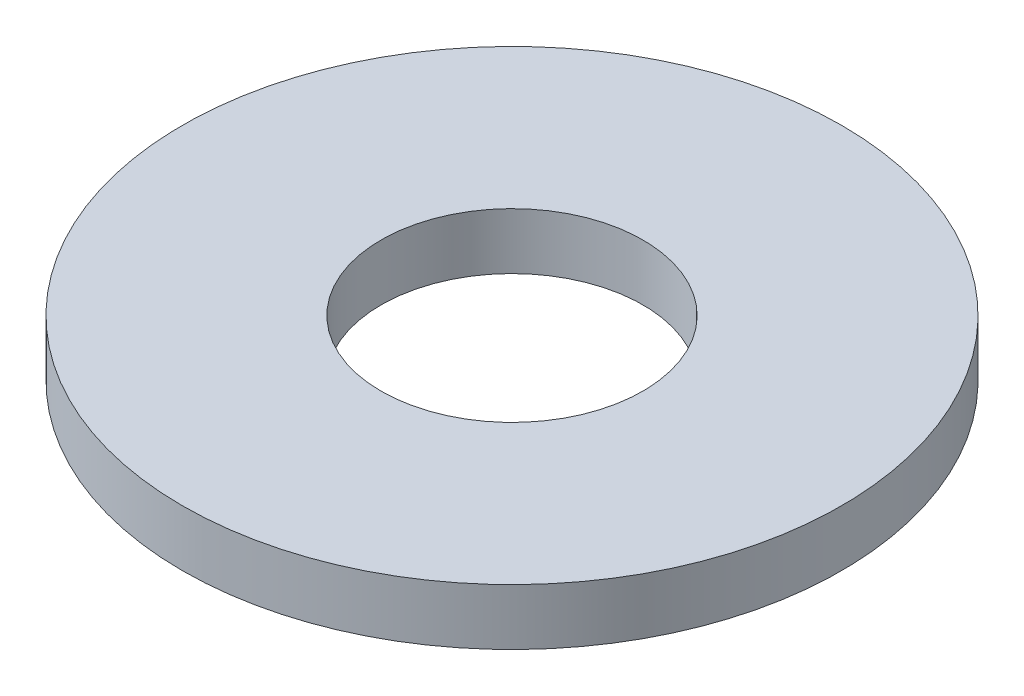
ISO-10303-21;
HEADER;
FILE_DESCRIPTION(('STEP AP214'),'2;1');
FILE_NAME('part.step','',(''),(''),'','','');
FILE_SCHEMA(('AUTOMOTIVE_DESIGN { 1 0 10303 214 1 1 1 1 }'));
ENDSEC;
DATA;
#1=APPLICATION_CONTEXT('core data for automotive mechanical design processes');
#2=APPLICATION_PROTOCOL_DEFINITION('international standard','automotive_design',2000,#1);
#3=PRODUCT_CONTEXT('',#1,'mechanical');
#4=PRODUCT('Part','Part','',(#3));
#5=PRODUCT_RELATED_PRODUCT_CATEGORY('part','',(#4));
#6=PRODUCT_DEFINITION_FORMATION('','',#4);
#7=PRODUCT_DEFINITION_CONTEXT('part definition',#1,'design');
#8=PRODUCT_DEFINITION('design','',#6,#7);
#9=PRODUCT_DEFINITION_SHAPE('','',#8);
#10=(LENGTH_UNIT() NAMED_UNIT(*) SI_UNIT(.MILLI.,.METRE.));
#11=(NAMED_UNIT(*) PLANE_ANGLE_UNIT() SI_UNIT($,.RADIAN.));
#12=(NAMED_UNIT(*) SI_UNIT($,.STERADIAN.) SOLID_ANGLE_UNIT());
#13=UNCERTAINTY_MEASURE_WITH_UNIT(LENGTH_MEASURE(1.E-05),#10,'distance_accuracy_value','');
#14=(GEOMETRIC_REPRESENTATION_CONTEXT(3) GLOBAL_UNCERTAINTY_ASSIGNED_CONTEXT((#13)) GLOBAL_UNIT_ASSIGNED_CONTEXT((#10,
#11,#12)) REPRESENTATION_CONTEXT('',''));
#15=CARTESIAN_POINT('',(0.,0.,0.));
#16=DIRECTION('',(0.,0.,1.));
#17=DIRECTION('',(1.,0.,0.));
#18=AXIS2_PLACEMENT_3D('',#15,#16,#17);
#19=CARTESIAN_POINT('',(0.,0.8128,0.));
#20=DIRECTION('',(0.,1.,0.));
#21=DIRECTION('',(0.,0.,1.));
#22=AXIS2_PLACEMENT_3D('',#19,#20,#21);
#23=PLANE('',#22);
#24=CARTESIAN_POINT('',(0.,0.8128,0.));
#25=DIRECTION('',(0.,1.,0.));
#26=DIRECTION('',(0.,0.,1.));
#27=AXIS2_PLACEMENT_3D('',#24,#25,#26);
#28=CIRCLE('',#27,4.7625);
#29=CARTESIAN_POINT('',(0.,0.8128,4.7625));
#30=VERTEX_POINT('',#29);
#31=EDGE_CURVE('E10',#30,#30,#28,.T.);
#32=ORIENTED_EDGE('',*,*,#31,.T.);
#33=EDGE_LOOP('',(#32));
#34=FACE_BOUND('',#33,.T.);
#35=CARTESIAN_POINT('',(0.,0.8128,0.));
#36=DIRECTION('',(0.,1.,0.));
#37=DIRECTION('',(0.,0.,1.));
#38=AXIS2_PLACEMENT_3D('',#35,#36,#37);
#39=CIRCLE('',#38,1.8923);
#40=CARTESIAN_POINT('',(0.,0.8128,1.8923));
#41=VERTEX_POINT('',#40);
#42=EDGE_CURVE('E41',#41,#41,#39,.T.);
#43=ORIENTED_EDGE('',*,*,#42,.F.);
#44=EDGE_LOOP('',(#43));
#45=FACE_BOUND('',#44,.T.);
#46=ADVANCED_FACE('F30',(#34,#45),#23,.T.);
#47=CARTESIAN_POINT('',(0.,0.,0.));
#48=DIRECTION('',(0.,1.,0.));
#49=DIRECTION('',(0.,0.,1.));
#50=AXIS2_PLACEMENT_3D('',#47,#48,#49);
#51=PLANE('',#50);
#52=CARTESIAN_POINT('',(0.,0.,0.));
#53=DIRECTION('',(0.,1.,0.));
#54=DIRECTION('',(0.,0.,1.));
#55=AXIS2_PLACEMENT_3D('',#52,#53,#54);
#56=CIRCLE('',#55,4.7625);
#57=CARTESIAN_POINT('',(0.,0.,4.7625));
#58=VERTEX_POINT('',#57);
#59=EDGE_CURVE('E34',#58,#58,#56,.T.);
#60=ORIENTED_EDGE('',*,*,#59,.F.);
#61=EDGE_LOOP('',(#60));
#62=FACE_BOUND('',#61,.T.);
#63=CARTESIAN_POINT('',(0.,0.,0.));
#64=DIRECTION('',(0.,1.,0.));
#65=DIRECTION('',(0.,0.,1.));
#66=AXIS2_PLACEMENT_3D('',#63,#64,#65);
#67=CIRCLE('',#66,1.8923);
#68=CARTESIAN_POINT('',(0.,0.,1.8923));
#69=VERTEX_POINT('',#68);
#70=EDGE_CURVE('E43',#69,#69,#67,.T.);
#71=ORIENTED_EDGE('',*,*,#70,.T.);
#72=EDGE_LOOP('',(#71));
#73=FACE_BOUND('',#72,.T.);
#74=ADVANCED_FACE('F53',(#62,#73),#51,.F.);
#75=CARTESIAN_POINT('',(0.,0.8128,0.));
#76=DIRECTION('',(0.,-1.,0.));
#77=DIRECTION('',(0.,0.,-1.));
#78=AXIS2_PLACEMENT_3D('',#75,#76,#77);
#79=CYLINDRICAL_SURFACE('',#78,4.7625);
#80=ORIENTED_EDGE('',*,*,#31,.F.);
#81=EDGE_LOOP('',(#80));
#82=FACE_BOUND('',#81,.T.);
#83=ORIENTED_EDGE('',*,*,#59,.T.);
#84=EDGE_LOOP('',(#83));
#85=FACE_BOUND('',#84,.T.);
#86=ADVANCED_FACE('F32',(#82,#85),#79,.T.);
#87=CARTESIAN_POINT('',(0.,0.8128,0.));
#88=DIRECTION('',(0.,-1.,0.));
#89=DIRECTION('',(0.,0.,-1.));
#90=AXIS2_PLACEMENT_3D('',#87,#88,#89);
#91=CYLINDRICAL_SURFACE('',#90,1.8923);
#92=ORIENTED_EDGE('',*,*,#42,.T.);
#93=EDGE_LOOP('',(#92));
#94=FACE_BOUND('',#93,.T.);
#95=ORIENTED_EDGE('',*,*,#70,.F.);
#96=EDGE_LOOP('',(#95));
#97=FACE_BOUND('',#96,.T.);
#98=ADVANCED_FACE('F49',(#94,#97),#91,.F.);
#99=CLOSED_SHELL('',(#46,#74,#86,#98));
#100=MANIFOLD_SOLID_BREP('B2',#99);
#101=ADVANCED_BREP_SHAPE_REPRESENTATION('',(#18,#100),#14);
#102=SHAPE_DEFINITION_REPRESENTATION(#9,#101);
ENDSEC;
END-ISO-10303-21;
